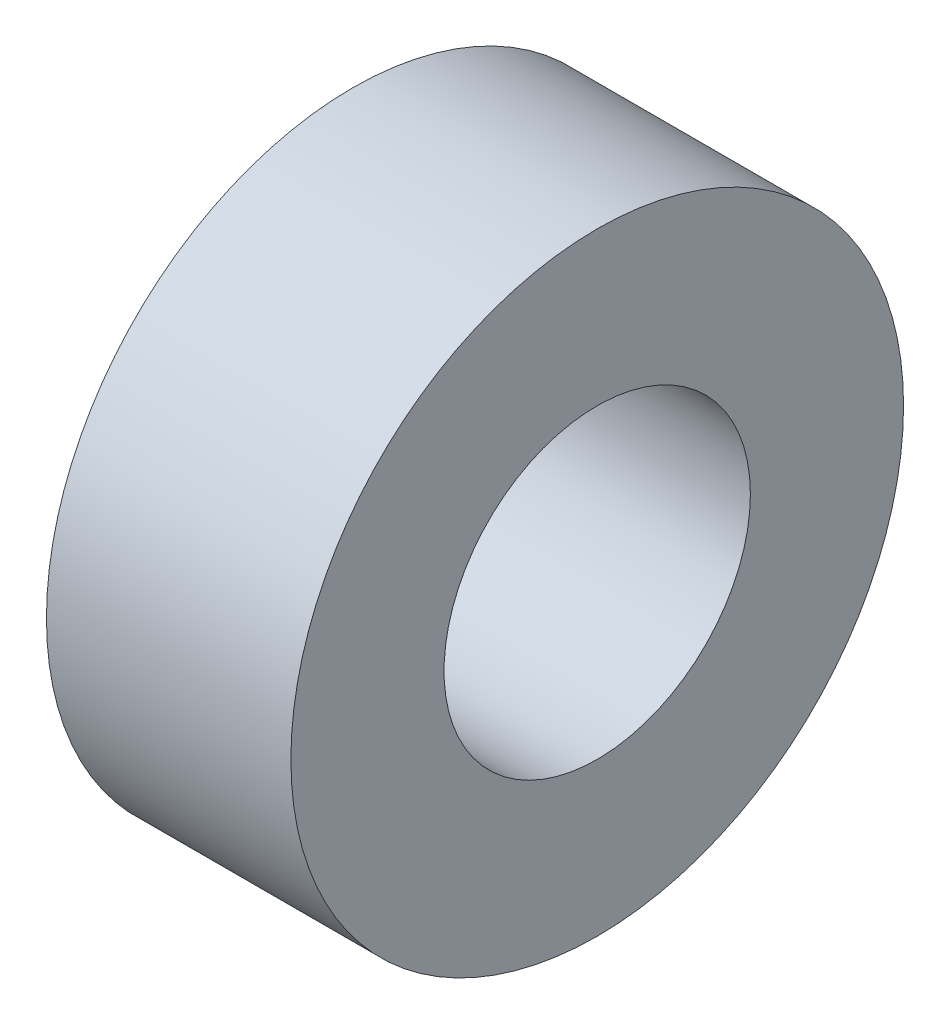
ISO-10303-21;
HEADER;
FILE_DESCRIPTION(('STEP AP214'),'2;1');
FILE_NAME('part.step','',(''),(''),'','','');
FILE_SCHEMA(('AUTOMOTIVE_DESIGN { 1 0 10303 214 1 1 1 1 }'));
ENDSEC;
DATA;
#1=APPLICATION_CONTEXT('core data for automotive mechanical design processes');
#2=APPLICATION_PROTOCOL_DEFINITION('international standard','automotive_design',2000,#1);
#3=PRODUCT_CONTEXT('',#1,'mechanical');
#4=PRODUCT('Part','Part','',(#3));
#5=PRODUCT_RELATED_PRODUCT_CATEGORY('part','',(#4));
#6=PRODUCT_DEFINITION_FORMATION('','',#4);
#7=PRODUCT_DEFINITION_CONTEXT('part definition',#1,'design');
#8=PRODUCT_DEFINITION('design','',#6,#7);
#9=PRODUCT_DEFINITION_SHAPE('','',#8);
#10=(LENGTH_UNIT() NAMED_UNIT(*) SI_UNIT(.MILLI.,.METRE.));
#11=(NAMED_UNIT(*) PLANE_ANGLE_UNIT() SI_UNIT($,.RADIAN.));
#12=(NAMED_UNIT(*) SI_UNIT($,.STERADIAN.) SOLID_ANGLE_UNIT());
#13=UNCERTAINTY_MEASURE_WITH_UNIT(LENGTH_MEASURE(1.E-05),#10,'distance_accuracy_value','');
#14=(GEOMETRIC_REPRESENTATION_CONTEXT(3) GLOBAL_UNCERTAINTY_ASSIGNED_CONTEXT((#13)) GLOBAL_UNIT_ASSIGNED_CONTEXT((#10,
#11,#12)) REPRESENTATION_CONTEXT('',''));
#15=CARTESIAN_POINT('',(0.,0.,0.));
#16=DIRECTION('',(0.,0.,1.));
#17=DIRECTION('',(1.,0.,0.));
#18=AXIS2_PLACEMENT_3D('',#15,#16,#17);
#19=CARTESIAN_POINT('',(7.60040136,0.,0.));
#20=DIRECTION('',(1.,0.,0.));
#21=DIRECTION('',(0.,0.,-1.));
#22=AXIS2_PLACEMENT_3D('',#19,#20,#21);
#23=PLANE('',#22);
#24=CARTESIAN_POINT('',(7.60040136,0.,0.));
#25=DIRECTION('',(1.,0.,0.));
#26=DIRECTION('',(0.,0.,-1.));
#27=AXIS2_PLACEMENT_3D('',#24,#25,#26);
#28=CIRCLE('',#27,9.525);
#29=CARTESIAN_POINT('',(7.60040136,0.,-9.525));
#30=VERTEX_POINT('',#29);
#31=EDGE_CURVE('E10',#30,#30,#28,.T.);
#32=ORIENTED_EDGE('',*,*,#31,.T.);
#33=EDGE_LOOP('',(#32));
#34=FACE_BOUND('',#33,.T.);
#35=CARTESIAN_POINT('',(7.60040136,0.,0.));
#36=DIRECTION('',(1.,0.,0.));
#37=DIRECTION('',(0.,0.,-1.));
#38=AXIS2_PLACEMENT_3D('',#35,#36,#37);
#39=CIRCLE('',#38,4.7625);
#40=CARTESIAN_POINT('',(7.60040136,0.,-4.7625));
#41=VERTEX_POINT('',#40);
#42=EDGE_CURVE('E42',#41,#41,#39,.T.);
#43=ORIENTED_EDGE('',*,*,#42,.F.);
#44=EDGE_LOOP('',(#43));
#45=FACE_BOUND('',#44,.T.);
#46=ADVANCED_FACE('F31',(#34,#45),#23,.T.);
#47=CARTESIAN_POINT('',(0.,0.,0.));
#48=DIRECTION('',(1.,0.,0.));
#49=DIRECTION('',(0.,0.,-1.));
#50=AXIS2_PLACEMENT_3D('',#47,#48,#49);
#51=PLANE('',#50);
#52=CARTESIAN_POINT('',(0.,0.,0.));
#53=DIRECTION('',(1.,0.,0.));
#54=DIRECTION('',(0.,0.,-1.));
#55=AXIS2_PLACEMENT_3D('',#52,#53,#54);
#56=CIRCLE('',#55,9.525);
#57=CARTESIAN_POINT('',(0.,0.,-9.525));
#58=VERTEX_POINT('',#57);
#59=EDGE_CURVE('E35',#58,#58,#56,.T.);
#60=ORIENTED_EDGE('',*,*,#59,.F.);
#61=EDGE_LOOP('',(#60));
#62=FACE_BOUND('',#61,.T.);
#63=CARTESIAN_POINT('',(0.,0.,0.));
#64=DIRECTION('',(1.,0.,0.));
#65=DIRECTION('',(0.,0.,-1.));
#66=AXIS2_PLACEMENT_3D('',#63,#64,#65);
#67=CIRCLE('',#66,4.7625);
#68=CARTESIAN_POINT('',(0.,0.,-4.7625));
#69=VERTEX_POINT('',#68);
#70=EDGE_CURVE('E44',#69,#69,#67,.T.);
#71=ORIENTED_EDGE('',*,*,#70,.T.);
#72=EDGE_LOOP('',(#71));
#73=FACE_BOUND('',#72,.T.);
#74=ADVANCED_FACE('F54',(#62,#73),#51,.F.);
#75=CARTESIAN_POINT('',(7.60040136,0.,0.));
#76=DIRECTION('',(-1.,0.,0.));
#77=DIRECTION('',(0.,0.,1.));
#78=AXIS2_PLACEMENT_3D('',#75,#76,#77);
#79=CYLINDRICAL_SURFACE('',#78,9.525);
#80=ORIENTED_EDGE('',*,*,#31,.F.);
#81=EDGE_LOOP('',(#80));
#82=FACE_BOUND('',#81,.T.);
#83=ORIENTED_EDGE('',*,*,#59,.T.);
#84=EDGE_LOOP('',(#83));
#85=FACE_BOUND('',#84,.T.);
#86=ADVANCED_FACE('F33',(#82,#85),#79,.T.);
#87=CARTESIAN_POINT('',(7.60040136,0.,0.));
#88=DIRECTION('',(-1.,0.,0.));
#89=DIRECTION('',(0.,0.,1.));
#90=AXIS2_PLACEMENT_3D('',#87,#88,#89);
#91=CYLINDRICAL_SURFACE('',#90,4.7625);
#92=ORIENTED_EDGE('',*,*,#42,.T.);
#93=EDGE_LOOP('',(#92));
#94=FACE_BOUND('',#93,.T.);
#95=ORIENTED_EDGE('',*,*,#70,.F.);
#96=EDGE_LOOP('',(#95));
#97=FACE_BOUND('',#96,.T.);
#98=ADVANCED_FACE('F50',(#94,#97),#91,.F.);
#99=CLOSED_SHELL('',(#46,#74,#86,#98));
#100=MANIFOLD_SOLID_BREP('B2',#99);
#101=ADVANCED_BREP_SHAPE_REPRESENTATION('',(#18,#100),#14);
#102=SHAPE_DEFINITION_REPRESENTATION(#9,#101);
ENDSEC;
END-ISO-10303-21;
